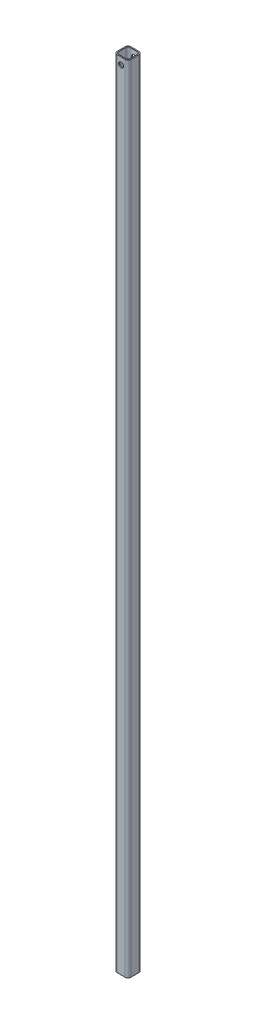
ISO-10303-21;
HEADER;
FILE_DESCRIPTION(('STEP AP214'),'2;1');
FILE_NAME('part.step','',(''),(''),'','','');
FILE_SCHEMA(('AUTOMOTIVE_DESIGN { 1 0 10303 214 1 1 1 1 }'));
ENDSEC;
DATA;
#1=APPLICATION_CONTEXT('core data for automotive mechanical design processes');
#2=APPLICATION_PROTOCOL_DEFINITION('international standard','automotive_design',2000,#1);
#3=PRODUCT_CONTEXT('',#1,'mechanical');
#4=PRODUCT('Part','Part','',(#3));
#5=PRODUCT_RELATED_PRODUCT_CATEGORY('part','',(#4));
#6=PRODUCT_DEFINITION_FORMATION('','',#4);
#7=PRODUCT_DEFINITION_CONTEXT('part definition',#1,'design');
#8=PRODUCT_DEFINITION('design','',#6,#7);
#9=PRODUCT_DEFINITION_SHAPE('','',#8);
#10=(LENGTH_UNIT() NAMED_UNIT(*) SI_UNIT(.MILLI.,.METRE.));
#11=(NAMED_UNIT(*) PLANE_ANGLE_UNIT() SI_UNIT($,.RADIAN.));
#12=(NAMED_UNIT(*) SI_UNIT($,.STERADIAN.) SOLID_ANGLE_UNIT());
#13=UNCERTAINTY_MEASURE_WITH_UNIT(LENGTH_MEASURE(1.E-05),#10,'distance_accuracy_value','');
#14=(GEOMETRIC_REPRESENTATION_CONTEXT(3) GLOBAL_UNCERTAINTY_ASSIGNED_CONTEXT((#13)) GLOBAL_UNIT_ASSIGNED_CONTEXT((#10,
#11,#12)) REPRESENTATION_CONTEXT('',''));
#15=CARTESIAN_POINT('',(0.,0.,0.));
#16=DIRECTION('',(0.,0.,1.));
#17=DIRECTION('',(1.,0.,0.));
#18=AXIS2_PLACEMENT_3D('',#15,#16,#17);
#19=CARTESIAN_POINT('',(9.525,914.4,-9.525));
#20=DIRECTION('',(0.,1.,0.));
#21=DIRECTION('',(0.,0.,1.));
#22=AXIS2_PLACEMENT_3D('',#19,#20,#21);
#23=PLANE('',#22);
#24=CARTESIAN_POINT('',(9.525,914.4,-9.525));
#25=DIRECTION('',(0.,1.,0.));
#26=DIRECTION('',(0.,0.,1.));
#27=AXIS2_PLACEMENT_3D('',#24,#25,#26);
#28=CIRCLE('',#27,6.35);
#29=CARTESIAN_POINT('',(15.875,914.4,-9.525));
#30=VERTEX_POINT('',#29);
#31=CARTESIAN_POINT('',(9.525,914.4,-15.875));
#32=VERTEX_POINT('',#31);
#33=EDGE_CURVE('E250',#30,#32,#28,.T.);
#34=ORIENTED_EDGE('',*,*,#33,.T.);
#35=DIRECTION('',(-1.,0.,0.));
#36=VECTOR('',#35,1.);
#37=CARTESIAN_POINT('',(9.525,914.4,-15.875));
#38=LINE('',#37,#36);
#39=CARTESIAN_POINT('',(-9.525,914.4,-15.875));
#40=VERTEX_POINT('',#39);
#41=EDGE_CURVE('E254',#32,#40,#38,.T.);
#42=ORIENTED_EDGE('',*,*,#41,.T.);
#43=CARTESIAN_POINT('',(-9.525,914.4,-9.525));
#44=DIRECTION('',(0.,1.,0.));
#45=DIRECTION('',(0.,0.,1.));
#46=AXIS2_PLACEMENT_3D('',#43,#44,#45);
#47=CIRCLE('',#46,6.35);
#48=CARTESIAN_POINT('',(-15.875,914.4,-9.525));
#49=VERTEX_POINT('',#48);
#50=EDGE_CURVE('E258',#40,#49,#47,.T.);
#51=ORIENTED_EDGE('',*,*,#50,.T.);
#52=DIRECTION('',(0.,0.,1.));
#53=VECTOR('',#52,1.);
#54=CARTESIAN_POINT('',(-15.875,914.4,9.525));
#55=LINE('',#54,#53);
#56=CARTESIAN_POINT('',(-15.875,914.4,9.525));
#57=VERTEX_POINT('',#56);
#58=EDGE_CURVE('E261',#49,#57,#55,.T.);
#59=ORIENTED_EDGE('',*,*,#58,.T.);
#60=CARTESIAN_POINT('',(-9.525,914.4,9.525));
#61=DIRECTION('',(0.,1.,0.));
#62=DIRECTION('',(0.,0.,1.));
#63=AXIS2_PLACEMENT_3D('',#60,#61,#62);
#64=CIRCLE('',#63,6.35);
#65=CARTESIAN_POINT('',(-9.525,914.4,15.875));
#66=VERTEX_POINT('',#65);
#67=EDGE_CURVE('E264',#57,#66,#64,.T.);
#68=ORIENTED_EDGE('',*,*,#67,.T.);
#69=DIRECTION('',(1.,0.,0.));
#70=VECTOR('',#69,1.);
#71=CARTESIAN_POINT('',(-9.525,914.4,15.875));
#72=LINE('',#71,#70);
#73=CARTESIAN_POINT('',(9.525,914.4,15.875));
#74=VERTEX_POINT('',#73);
#75=EDGE_CURVE('E267',#66,#74,#72,.T.);
#76=ORIENTED_EDGE('',*,*,#75,.T.);
#77=CARTESIAN_POINT('',(9.525,914.4,9.525));
#78=DIRECTION('',(0.,1.,0.));
#79=DIRECTION('',(0.,0.,1.));
#80=AXIS2_PLACEMENT_3D('',#77,#78,#79);
#81=CIRCLE('',#80,6.35);
#82=CARTESIAN_POINT('',(15.875,914.4,9.525));
#83=VERTEX_POINT('',#82);
#84=EDGE_CURVE('E270',#74,#83,#81,.T.);
#85=ORIENTED_EDGE('',*,*,#84,.T.);
#86=DIRECTION('',(0.,0.,-1.));
#87=VECTOR('',#86,1.);
#88=CARTESIAN_POINT('',(15.875,914.4,-9.525));
#89=LINE('',#88,#87);
#90=EDGE_CURVE('E273',#83,#30,#89,.T.);
#91=ORIENTED_EDGE('',*,*,#90,.T.);
#92=EDGE_LOOP('',(#34,#42,#51,#59,#68,#76,#85,#91));
#93=FACE_BOUND('',#92,.T.);
#94=DIRECTION('',(0.,0.,1.));
#95=VECTOR('',#94,1.);
#96=CARTESIAN_POINT('',(-13.462,914.4,8.6995));
#97=LINE('',#96,#95);
#98=CARTESIAN_POINT('',(-13.462,914.4,-8.6995));
#99=VERTEX_POINT('',#98);
#100=CARTESIAN_POINT('',(-13.462,914.4,8.6995));
#101=VERTEX_POINT('',#100);
#102=EDGE_CURVE('E176',#99,#101,#97,.T.);
#103=ORIENTED_EDGE('',*,*,#102,.F.);
#104=CARTESIAN_POINT('',(-8.6995,914.4,-8.6995));
#105=DIRECTION('',(0.,1.,0.));
#106=DIRECTION('',(0.,0.,1.));
#107=AXIS2_PLACEMENT_3D('',#104,#105,#106);
#108=CIRCLE('',#107,4.7625);
#109=CARTESIAN_POINT('',(-8.6995,914.4,-13.462));
#110=VERTEX_POINT('',#109);
#111=EDGE_CURVE('E167',#110,#99,#108,.T.);
#112=ORIENTED_EDGE('',*,*,#111,.F.);
#113=DIRECTION('',(-1.,0.,0.));
#114=VECTOR('',#113,1.);
#115=CARTESIAN_POINT('',(8.6995,914.4,-13.462));
#116=LINE('',#115,#114);
#117=CARTESIAN_POINT('',(8.6995,914.4,-13.462));
#118=VERTEX_POINT('',#117);
#119=EDGE_CURVE('E210',#118,#110,#116,.T.);
#120=ORIENTED_EDGE('',*,*,#119,.F.);
#121=CARTESIAN_POINT('',(8.6995,914.4,-8.69950000000001));
#122=DIRECTION('',(0.,1.,0.));
#123=DIRECTION('',(0.,0.,1.));
#124=AXIS2_PLACEMENT_3D('',#121,#122,#123);
#125=CIRCLE('',#124,4.7625);
#126=CARTESIAN_POINT('',(13.462,914.4,-8.69950000000001));
#127=VERTEX_POINT('',#126);
#128=EDGE_CURVE('E207',#127,#118,#125,.T.);
#129=ORIENTED_EDGE('',*,*,#128,.F.);
#130=DIRECTION('',(0.,0.,-1.));
#131=VECTOR('',#130,1.);
#132=CARTESIAN_POINT('',(13.462,914.4,-8.69950000000001));
#133=LINE('',#132,#131);
#134=CARTESIAN_POINT('',(13.462,914.4,8.69950000000001));
#135=VERTEX_POINT('',#134);
#136=EDGE_CURVE('E204',#135,#127,#133,.T.);
#137=ORIENTED_EDGE('',*,*,#136,.F.);
#138=CARTESIAN_POINT('',(8.6995,914.4,8.69950000000001));
#139=DIRECTION('',(0.,1.,0.));
#140=DIRECTION('',(0.,0.,1.));
#141=AXIS2_PLACEMENT_3D('',#138,#139,#140);
#142=CIRCLE('',#141,4.7625);
#143=CARTESIAN_POINT('',(8.6995,914.4,13.462));
#144=VERTEX_POINT('',#143);
#145=EDGE_CURVE('E201',#144,#135,#142,.T.);
#146=ORIENTED_EDGE('',*,*,#145,.F.);
#147=DIRECTION('',(1.,0.,0.));
#148=VECTOR('',#147,1.);
#149=CARTESIAN_POINT('',(-8.6995,914.4,13.462));
#150=LINE('',#149,#148);
#151=CARTESIAN_POINT('',(-8.6995,914.4,13.462));
#152=VERTEX_POINT('',#151);
#153=EDGE_CURVE('E195',#152,#144,#150,.T.);
#154=ORIENTED_EDGE('',*,*,#153,.F.);
#155=CARTESIAN_POINT('',(-8.6995,914.4,8.6995));
#156=DIRECTION('',(0.,1.,0.));
#157=DIRECTION('',(0.,0.,1.));
#158=AXIS2_PLACEMENT_3D('',#155,#156,#157);
#159=CIRCLE('',#158,4.7625);
#160=EDGE_CURVE('E190',#101,#152,#159,.T.);
#161=ORIENTED_EDGE('',*,*,#160,.F.);
#162=EDGE_LOOP('',(#103,#112,#120,#129,#137,#146,#154,#161));
#163=FACE_BOUND('',#162,.T.);
#164=ADVANCED_FACE('F36',(#93,#163),#23,.T.);
#165=CARTESIAN_POINT('',(9.525,-914.4,-9.525));
#166=DIRECTION('',(0.,1.,0.));
#167=DIRECTION('',(0.,0.,1.));
#168=AXIS2_PLACEMENT_3D('',#165,#166,#167);
#169=PLANE('',#168);
#170=CARTESIAN_POINT('',(9.525,-914.4,-9.525));
#171=DIRECTION('',(0.,1.,0.));
#172=DIRECTION('',(0.,0.,1.));
#173=AXIS2_PLACEMENT_3D('',#170,#171,#172);
#174=CIRCLE('',#173,6.35);
#175=CARTESIAN_POINT('',(15.875,-914.4,-9.525));
#176=VERTEX_POINT('',#175);
#177=CARTESIAN_POINT('',(9.525,-914.4,-15.875));
#178=VERTEX_POINT('',#177);
#179=EDGE_CURVE('E185',#176,#178,#174,.T.);
#180=ORIENTED_EDGE('',*,*,#179,.F.);
#181=DIRECTION('',(0.,0.,-1.));
#182=VECTOR('',#181,1.);
#183=CARTESIAN_POINT('',(15.875,-914.4,-9.525));
#184=LINE('',#183,#182);
#185=CARTESIAN_POINT('',(15.875,-914.4,9.525));
#186=VERTEX_POINT('',#185);
#187=EDGE_CURVE('E255',#186,#176,#184,.T.);
#188=ORIENTED_EDGE('',*,*,#187,.F.);
#189=CARTESIAN_POINT('',(9.525,-914.4,9.525));
#190=DIRECTION('',(0.,1.,0.));
#191=DIRECTION('',(0.,0.,1.));
#192=AXIS2_PLACEMENT_3D('',#189,#190,#191);
#193=CIRCLE('',#192,6.35);
#194=CARTESIAN_POINT('',(9.525,-914.4,15.875));
#195=VERTEX_POINT('',#194);
#196=EDGE_CURVE('E289',#195,#186,#193,.T.);
#197=ORIENTED_EDGE('',*,*,#196,.F.);
#198=DIRECTION('',(1.,0.,0.));
#199=VECTOR('',#198,1.);
#200=CARTESIAN_POINT('',(-9.525,-914.4,15.875));
#201=LINE('',#200,#199);
#202=CARTESIAN_POINT('',(-9.525,-914.4,15.875));
#203=VERTEX_POINT('',#202);
#204=EDGE_CURVE('E287',#203,#195,#201,.T.);
#205=ORIENTED_EDGE('',*,*,#204,.F.);
#206=CARTESIAN_POINT('',(-9.525,-914.4,9.525));
#207=DIRECTION('',(0.,1.,0.));
#208=DIRECTION('',(0.,0.,1.));
#209=AXIS2_PLACEMENT_3D('',#206,#207,#208);
#210=CIRCLE('',#209,6.35);
#211=CARTESIAN_POINT('',(-15.875,-914.4,9.525));
#212=VERTEX_POINT('',#211);
#213=EDGE_CURVE('E285',#212,#203,#210,.T.);
#214=ORIENTED_EDGE('',*,*,#213,.F.);
#215=DIRECTION('',(0.,0.,1.));
#216=VECTOR('',#215,1.);
#217=CARTESIAN_POINT('',(-15.875,-914.4,9.525));
#218=LINE('',#217,#216);
#219=CARTESIAN_POINT('',(-15.875,-914.4,-9.525));
#220=VERTEX_POINT('',#219);
#221=EDGE_CURVE('E283',#220,#212,#218,.T.);
#222=ORIENTED_EDGE('',*,*,#221,.F.);
#223=CARTESIAN_POINT('',(-9.525,-914.4,-9.525));
#224=DIRECTION('',(0.,1.,0.));
#225=DIRECTION('',(0.,0.,1.));
#226=AXIS2_PLACEMENT_3D('',#223,#224,#225);
#227=CIRCLE('',#226,6.35);
#228=CARTESIAN_POINT('',(-9.525,-914.4,-15.875));
#229=VERTEX_POINT('',#228);
#230=EDGE_CURVE('E281',#229,#220,#227,.T.);
#231=ORIENTED_EDGE('',*,*,#230,.F.);
#232=DIRECTION('',(-1.,0.,0.));
#233=VECTOR('',#232,1.);
#234=CARTESIAN_POINT('',(9.525,-914.4,-15.875));
#235=LINE('',#234,#233);
#236=EDGE_CURVE('E279',#178,#229,#235,.T.);
#237=ORIENTED_EDGE('',*,*,#236,.F.);
#238=EDGE_LOOP('',(#180,#188,#197,#205,#214,#222,#231,#237));
#239=FACE_BOUND('',#238,.T.);
#240=CARTESIAN_POINT('',(-8.6995,-914.4,-8.6995));
#241=DIRECTION('',(0.,1.,0.));
#242=DIRECTION('',(0.,0.,1.));
#243=AXIS2_PLACEMENT_3D('',#240,#241,#242);
#244=CIRCLE('',#243,4.7625);
#245=CARTESIAN_POINT('',(-8.6995,-914.4,-13.462));
#246=VERTEX_POINT('',#245);
#247=CARTESIAN_POINT('',(-13.462,-914.4,-8.6995));
#248=VERTEX_POINT('',#247);
#249=EDGE_CURVE('E64',#246,#248,#244,.T.);
#250=ORIENTED_EDGE('',*,*,#249,.T.);
#251=DIRECTION('',(0.,0.,1.));
#252=VECTOR('',#251,1.);
#253=CARTESIAN_POINT('',(-13.462,-914.4,8.6995));
#254=LINE('',#253,#252);
#255=CARTESIAN_POINT('',(-13.462,-914.4,8.6995));
#256=VERTEX_POINT('',#255);
#257=EDGE_CURVE('E183',#248,#256,#254,.T.);
#258=ORIENTED_EDGE('',*,*,#257,.T.);
#259=CARTESIAN_POINT('',(-8.6995,-914.4,8.6995));
#260=DIRECTION('',(0.,1.,0.));
#261=DIRECTION('',(0.,0.,1.));
#262=AXIS2_PLACEMENT_3D('',#259,#260,#261);
#263=CIRCLE('',#262,4.7625);
#264=CARTESIAN_POINT('',(-8.6995,-914.4,13.462));
#265=VERTEX_POINT('',#264);
#266=EDGE_CURVE('E216',#256,#265,#263,.T.);
#267=ORIENTED_EDGE('',*,*,#266,.T.);
#268=DIRECTION('',(1.,0.,0.));
#269=VECTOR('',#268,1.);
#270=CARTESIAN_POINT('',(-8.6995,-914.4,13.462));
#271=LINE('',#270,#269);
#272=CARTESIAN_POINT('',(8.6995,-914.4,13.462));
#273=VERTEX_POINT('',#272);
#274=EDGE_CURVE('E219',#265,#273,#271,.T.);
#275=ORIENTED_EDGE('',*,*,#274,.T.);
#276=CARTESIAN_POINT('',(8.6995,-914.4,8.69950000000001));
#277=DIRECTION('',(0.,1.,0.));
#278=DIRECTION('',(0.,0.,1.));
#279=AXIS2_PLACEMENT_3D('',#276,#277,#278);
#280=CIRCLE('',#279,4.7625);
#281=CARTESIAN_POINT('',(13.462,-914.4,8.69950000000001));
#282=VERTEX_POINT('',#281);
#283=EDGE_CURVE('E222',#273,#282,#280,.T.);
#284=ORIENTED_EDGE('',*,*,#283,.T.);
#285=DIRECTION('',(0.,0.,-1.));
#286=VECTOR('',#285,1.);
#287=CARTESIAN_POINT('',(13.462,-914.4,-8.69950000000001));
#288=LINE('',#287,#286);
#289=CARTESIAN_POINT('',(13.462,-914.4,-8.69950000000001));
#290=VERTEX_POINT('',#289);
#291=EDGE_CURVE('E225',#282,#290,#288,.T.);
#292=ORIENTED_EDGE('',*,*,#291,.T.);
#293=CARTESIAN_POINT('',(8.6995,-914.4,-8.69950000000001));
#294=DIRECTION('',(0.,1.,0.));
#295=DIRECTION('',(0.,0.,1.));
#296=AXIS2_PLACEMENT_3D('',#293,#294,#295);
#297=CIRCLE('',#296,4.7625);
#298=CARTESIAN_POINT('',(8.6995,-914.4,-13.462));
#299=VERTEX_POINT('',#298);
#300=EDGE_CURVE('E228',#290,#299,#297,.T.);
#301=ORIENTED_EDGE('',*,*,#300,.T.);
#302=DIRECTION('',(-1.,0.,0.));
#303=VECTOR('',#302,1.);
#304=CARTESIAN_POINT('',(8.6995,-914.4,-13.462));
#305=LINE('',#304,#303);
#306=EDGE_CURVE('E177',#299,#246,#305,.T.);
#307=ORIENTED_EDGE('',*,*,#306,.T.);
#308=EDGE_LOOP('',(#250,#258,#267,#275,#284,#292,#301,#307));
#309=FACE_BOUND('',#308,.T.);
#310=ADVANCED_FACE('F328',(#239,#309),#169,.F.);
#311=CARTESIAN_POINT('',(9.525,914.4,-9.525));
#312=DIRECTION('',(0.,-1.,0.));
#313=DIRECTION('',(0.,0.,-1.));
#314=AXIS2_PLACEMENT_3D('',#311,#312,#313);
#315=CYLINDRICAL_SURFACE('',#314,6.35);
#316=ORIENTED_EDGE('',*,*,#179,.T.);
#317=DIRECTION('',(0.,-1.,0.));
#318=VECTOR('',#317,1.);
#319=CARTESIAN_POINT('',(9.525,914.4,-15.875));
#320=LINE('',#319,#318);
#321=EDGE_CURVE('E11',#32,#178,#320,.T.);
#322=ORIENTED_EDGE('',*,*,#321,.F.);
#323=ORIENTED_EDGE('',*,*,#33,.F.);
#324=DIRECTION('',(0.,-1.,0.));
#325=VECTOR('',#324,1.);
#326=CARTESIAN_POINT('',(15.875,914.4,-9.525));
#327=LINE('',#326,#325);
#328=EDGE_CURVE('E276',#30,#176,#327,.T.);
#329=ORIENTED_EDGE('',*,*,#328,.T.);
#330=EDGE_LOOP('',(#316,#322,#323,#329));
#331=FACE_BOUND('',#330,.T.);
#332=ADVANCED_FACE('F38',(#331),#315,.T.);
#333=CARTESIAN_POINT('',(9.525,914.4,-15.875));
#334=DIRECTION('',(0.,0.,1.));
#335=DIRECTION('',(1.,0.,0.));
#336=AXIS2_PLACEMENT_3D('',#333,#334,#335);
#337=PLANE('',#336);
#338=CARTESIAN_POINT('',(0.,898.525,-15.875));
#339=DIRECTION('',(0.,0.,1.));
#340=DIRECTION('',(1.,0.,0.));
#341=AXIS2_PLACEMENT_3D('',#338,#339,#340);
#342=CIRCLE('',#341,5.71499999999998);
#343=CARTESIAN_POINT('',(5.71499999999998,898.525,-15.875));
#344=VERTEX_POINT('',#343);
#345=EDGE_CURVE('E425',#344,#344,#342,.T.);
#346=ORIENTED_EDGE('',*,*,#345,.T.);
#347=EDGE_LOOP('',(#346));
#348=FACE_BOUND('',#347,.T.);
#349=ORIENTED_EDGE('',*,*,#236,.T.);
#350=DIRECTION('',(0.,-1.,0.));
#351=VECTOR('',#350,1.);
#352=CARTESIAN_POINT('',(-9.525,914.4,-15.875));
#353=LINE('',#352,#351);
#354=EDGE_CURVE('E46',#40,#229,#353,.T.);
#355=ORIENTED_EDGE('',*,*,#354,.F.);
#356=ORIENTED_EDGE('',*,*,#41,.F.);
#357=ORIENTED_EDGE('',*,*,#321,.T.);
#358=EDGE_LOOP('',(#349,#355,#356,#357));
#359=FACE_BOUND('',#358,.T.);
#360=ADVANCED_FACE('F345',(#348,#359),#337,.F.);
#361=CARTESIAN_POINT('',(-9.525,914.4,-9.525));
#362=DIRECTION('',(0.,-1.,0.));
#363=DIRECTION('',(0.,0.,-1.));
#364=AXIS2_PLACEMENT_3D('',#361,#362,#363);
#365=CYLINDRICAL_SURFACE('',#364,6.35);
#366=ORIENTED_EDGE('',*,*,#230,.T.);
#367=DIRECTION('',(0.,-1.,0.));
#368=VECTOR('',#367,1.);
#369=CARTESIAN_POINT('',(-15.875,914.4,-9.525));
#370=LINE('',#369,#368);
#371=EDGE_CURVE('E311',#49,#220,#370,.T.);
#372=ORIENTED_EDGE('',*,*,#371,.F.);
#373=ORIENTED_EDGE('',*,*,#50,.F.);
#374=ORIENTED_EDGE('',*,*,#354,.T.);
#375=EDGE_LOOP('',(#366,#372,#373,#374));
#376=FACE_BOUND('',#375,.T.);
#377=ADVANCED_FACE('F322',(#376),#365,.T.);
#378=CARTESIAN_POINT('',(-15.875,914.4,9.525));
#379=DIRECTION('',(1.,0.,0.));
#380=DIRECTION('',(0.,0.,-1.));
#381=AXIS2_PLACEMENT_3D('',#378,#379,#380);
#382=PLANE('',#381);
#383=ORIENTED_EDGE('',*,*,#221,.T.);
#384=DIRECTION('',(0.,-1.,0.));
#385=VECTOR('',#384,1.);
#386=CARTESIAN_POINT('',(-15.875,914.4,9.525));
#387=LINE('',#386,#385);
#388=EDGE_CURVE('E307',#57,#212,#387,.T.);
#389=ORIENTED_EDGE('',*,*,#388,.F.);
#390=ORIENTED_EDGE('',*,*,#58,.F.);
#391=ORIENTED_EDGE('',*,*,#371,.T.);
#392=EDGE_LOOP('',(#383,#389,#390,#391));
#393=FACE_BOUND('',#392,.T.);
#394=ADVANCED_FACE('F334',(#393),#382,.F.);
#395=CARTESIAN_POINT('',(-9.525,914.4,9.525));
#396=DIRECTION('',(0.,-1.,0.));
#397=DIRECTION('',(0.,0.,-1.));
#398=AXIS2_PLACEMENT_3D('',#395,#396,#397);
#399=CYLINDRICAL_SURFACE('',#398,6.35);
#400=ORIENTED_EDGE('',*,*,#213,.T.);
#401=DIRECTION('',(0.,-1.,0.));
#402=VECTOR('',#401,1.);
#403=CARTESIAN_POINT('',(-9.525,914.4,15.875));
#404=LINE('',#403,#402);
#405=EDGE_CURVE('E303',#66,#203,#404,.T.);
#406=ORIENTED_EDGE('',*,*,#405,.F.);
#407=ORIENTED_EDGE('',*,*,#67,.F.);
#408=ORIENTED_EDGE('',*,*,#388,.T.);
#409=EDGE_LOOP('',(#400,#406,#407,#408));
#410=FACE_BOUND('',#409,.T.);
#411=ADVANCED_FACE('F338',(#410),#399,.T.);
#412=CARTESIAN_POINT('',(-9.525,914.4,15.875));
#413=DIRECTION('',(0.,0.,-1.));
#414=DIRECTION('',(-1.,0.,0.));
#415=AXIS2_PLACEMENT_3D('',#412,#413,#414);
#416=PLANE('',#415);
#417=CARTESIAN_POINT('',(0.,898.525,15.875));
#418=DIRECTION('',(0.,0.,1.));
#419=DIRECTION('',(1.,0.,0.));
#420=AXIS2_PLACEMENT_3D('',#417,#418,#419);
#421=CIRCLE('',#420,5.71499999999998);
#422=CARTESIAN_POINT('',(5.71499999999998,898.525,15.875));
#423=VERTEX_POINT('',#422);
#424=EDGE_CURVE('E428',#423,#423,#421,.T.);
#425=ORIENTED_EDGE('',*,*,#424,.F.);
#426=EDGE_LOOP('',(#425));
#427=FACE_BOUND('',#426,.T.);
#428=ORIENTED_EDGE('',*,*,#204,.T.);
#429=DIRECTION('',(0.,-1.,0.));
#430=VECTOR('',#429,1.);
#431=CARTESIAN_POINT('',(9.525,914.4,15.875));
#432=LINE('',#431,#430);
#433=EDGE_CURVE('E299',#74,#195,#432,.T.);
#434=ORIENTED_EDGE('',*,*,#433,.F.);
#435=ORIENTED_EDGE('',*,*,#75,.F.);
#436=ORIENTED_EDGE('',*,*,#405,.T.);
#437=EDGE_LOOP('',(#428,#434,#435,#436));
#438=FACE_BOUND('',#437,.T.);
#439=ADVANCED_FACE('F358',(#427,#438),#416,.F.);
#440=CARTESIAN_POINT('',(9.525,914.4,9.525));
#441=DIRECTION('',(0.,-1.,0.));
#442=DIRECTION('',(0.,0.,-1.));
#443=AXIS2_PLACEMENT_3D('',#440,#441,#442);
#444=CYLINDRICAL_SURFACE('',#443,6.35);
#445=ORIENTED_EDGE('',*,*,#196,.T.);
#446=DIRECTION('',(0.,-1.,0.));
#447=VECTOR('',#446,1.);
#448=CARTESIAN_POINT('',(15.875,914.4,9.525));
#449=LINE('',#448,#447);
#450=EDGE_CURVE('E295',#83,#186,#449,.T.);
#451=ORIENTED_EDGE('',*,*,#450,.F.);
#452=ORIENTED_EDGE('',*,*,#84,.F.);
#453=ORIENTED_EDGE('',*,*,#433,.T.);
#454=EDGE_LOOP('',(#445,#451,#452,#453));
#455=FACE_BOUND('',#454,.T.);
#456=ADVANCED_FACE('F356',(#455),#444,.T.);
#457=CARTESIAN_POINT('',(15.875,914.4,-9.525));
#458=DIRECTION('',(-1.,0.,0.));
#459=DIRECTION('',(0.,0.,1.));
#460=AXIS2_PLACEMENT_3D('',#457,#458,#459);
#461=PLANE('',#460);
#462=ORIENTED_EDGE('',*,*,#187,.T.);
#463=ORIENTED_EDGE('',*,*,#328,.F.);
#464=ORIENTED_EDGE('',*,*,#90,.F.);
#465=ORIENTED_EDGE('',*,*,#450,.T.);
#466=EDGE_LOOP('',(#462,#463,#464,#465));
#467=FACE_BOUND('',#466,.T.);
#468=ADVANCED_FACE('F351',(#467),#461,.F.);
#469=CARTESIAN_POINT('',(-8.6995,914.4,-8.6995));
#470=DIRECTION('',(0.,-1.,0.));
#471=DIRECTION('',(0.,0.,-1.));
#472=AXIS2_PLACEMENT_3D('',#469,#470,#471);
#473=CYLINDRICAL_SURFACE('',#472,4.7625);
#474=ORIENTED_EDGE('',*,*,#249,.F.);
#475=DIRECTION('',(0.,-1.,0.));
#476=VECTOR('',#475,1.);
#477=CARTESIAN_POINT('',(-8.6995,914.4,-13.462));
#478=LINE('',#477,#476);
#479=EDGE_CURVE('E171',#110,#246,#478,.T.);
#480=ORIENTED_EDGE('',*,*,#479,.F.);
#481=ORIENTED_EDGE('',*,*,#111,.T.);
#482=DIRECTION('',(0.,-1.,0.));
#483=VECTOR('',#482,1.);
#484=CARTESIAN_POINT('',(-13.462,914.4,-8.6995));
#485=LINE('',#484,#483);
#486=EDGE_CURVE('E170',#99,#248,#485,.T.);
#487=ORIENTED_EDGE('',*,*,#486,.T.);
#488=EDGE_LOOP('',(#474,#480,#481,#487));
#489=FACE_BOUND('',#488,.T.);
#490=ADVANCED_FACE('F169',(#489),#473,.F.);
#491=CARTESIAN_POINT('',(-13.462,914.4,8.6995));
#492=DIRECTION('',(1.,0.,0.));
#493=DIRECTION('',(0.,0.,-1.));
#494=AXIS2_PLACEMENT_3D('',#491,#492,#493);
#495=PLANE('',#494);
#496=ORIENTED_EDGE('',*,*,#257,.F.);
#497=ORIENTED_EDGE('',*,*,#486,.F.);
#498=ORIENTED_EDGE('',*,*,#102,.T.);
#499=DIRECTION('',(0.,-1.,0.));
#500=VECTOR('',#499,1.);
#501=CARTESIAN_POINT('',(-13.462,914.4,8.6995));
#502=LINE('',#501,#500);
#503=EDGE_CURVE('E186',#101,#256,#502,.T.);
#504=ORIENTED_EDGE('',*,*,#503,.T.);
#505=EDGE_LOOP('',(#496,#497,#498,#504));
#506=FACE_BOUND('',#505,.T.);
#507=ADVANCED_FACE('F180',(#506),#495,.T.);
#508=CARTESIAN_POINT('',(-8.6995,914.4,8.6995));
#509=DIRECTION('',(0.,-1.,0.));
#510=DIRECTION('',(0.,0.,-1.));
#511=AXIS2_PLACEMENT_3D('',#508,#509,#510);
#512=CYLINDRICAL_SURFACE('',#511,4.7625);
#513=ORIENTED_EDGE('',*,*,#266,.F.);
#514=ORIENTED_EDGE('',*,*,#503,.F.);
#515=ORIENTED_EDGE('',*,*,#160,.T.);
#516=DIRECTION('',(0.,-1.,0.));
#517=VECTOR('',#516,1.);
#518=CARTESIAN_POINT('',(-8.6995,914.4,13.462));
#519=LINE('',#518,#517);
#520=EDGE_CURVE('E245',#152,#265,#519,.T.);
#521=ORIENTED_EDGE('',*,*,#520,.T.);
#522=EDGE_LOOP('',(#513,#514,#515,#521));
#523=FACE_BOUND('',#522,.T.);
#524=ADVANCED_FACE('F385',(#523),#512,.F.);
#525=CARTESIAN_POINT('',(-8.6995,914.4,13.462));
#526=DIRECTION('',(0.,0.,-1.));
#527=DIRECTION('',(-1.,0.,0.));
#528=AXIS2_PLACEMENT_3D('',#525,#526,#527);
#529=PLANE('',#528);
#530=CARTESIAN_POINT('',(0.,898.525,13.462));
#531=DIRECTION('',(0.,0.,-1.));
#532=DIRECTION('',(-1.,0.,0.));
#533=AXIS2_PLACEMENT_3D('',#530,#531,#532);
#534=CIRCLE('',#533,5.71499999999998);
#535=CARTESIAN_POINT('',(-5.71499999999999,898.525,13.462));
#536=VERTEX_POINT('',#535);
#537=EDGE_CURVE('E214',#536,#536,#534,.T.);
#538=ORIENTED_EDGE('',*,*,#537,.F.);
#539=EDGE_LOOP('',(#538));
#540=FACE_BOUND('',#539,.T.);
#541=ORIENTED_EDGE('',*,*,#274,.F.);
#542=ORIENTED_EDGE('',*,*,#520,.F.);
#543=ORIENTED_EDGE('',*,*,#153,.T.);
#544=DIRECTION('',(0.,-1.,0.));
#545=VECTOR('',#544,1.);
#546=CARTESIAN_POINT('',(8.6995,914.4,13.462));
#547=LINE('',#546,#545);
#548=EDGE_CURVE('E242',#144,#273,#547,.T.);
#549=ORIENTED_EDGE('',*,*,#548,.T.);
#550=EDGE_LOOP('',(#541,#542,#543,#549));
#551=FACE_BOUND('',#550,.T.);
#552=ADVANCED_FACE('F389',(#540,#551),#529,.T.);
#553=CARTESIAN_POINT('',(8.6995,914.4,8.69950000000001));
#554=DIRECTION('',(0.,-1.,0.));
#555=DIRECTION('',(0.,0.,-1.));
#556=AXIS2_PLACEMENT_3D('',#553,#554,#555);
#557=CYLINDRICAL_SURFACE('',#556,4.7625);
#558=ORIENTED_EDGE('',*,*,#283,.F.);
#559=ORIENTED_EDGE('',*,*,#548,.F.);
#560=ORIENTED_EDGE('',*,*,#145,.T.);
#561=DIRECTION('',(0.,-1.,0.));
#562=VECTOR('',#561,1.);
#563=CARTESIAN_POINT('',(13.462,914.4,8.69950000000001));
#564=LINE('',#563,#562);
#565=EDGE_CURVE('E239',#135,#282,#564,.T.);
#566=ORIENTED_EDGE('',*,*,#565,.T.);
#567=EDGE_LOOP('',(#558,#559,#560,#566));
#568=FACE_BOUND('',#567,.T.);
#569=ADVANCED_FACE('F395',(#568),#557,.F.);
#570=CARTESIAN_POINT('',(13.462,914.4,-8.69950000000001));
#571=DIRECTION('',(-1.,0.,0.));
#572=DIRECTION('',(0.,0.,1.));
#573=AXIS2_PLACEMENT_3D('',#570,#571,#572);
#574=PLANE('',#573);
#575=ORIENTED_EDGE('',*,*,#291,.F.);
#576=ORIENTED_EDGE('',*,*,#565,.F.);
#577=ORIENTED_EDGE('',*,*,#136,.T.);
#578=DIRECTION('',(0.,-1.,0.));
#579=VECTOR('',#578,1.);
#580=CARTESIAN_POINT('',(13.462,914.4,-8.69950000000001));
#581=LINE('',#580,#579);
#582=EDGE_CURVE('E236',#127,#290,#581,.T.);
#583=ORIENTED_EDGE('',*,*,#582,.T.);
#584=EDGE_LOOP('',(#575,#576,#577,#583));
#585=FACE_BOUND('',#584,.T.);
#586=ADVANCED_FACE('F399',(#585),#574,.T.);
#587=CARTESIAN_POINT('',(8.6995,914.4,-8.69950000000001));
#588=DIRECTION('',(0.,-1.,0.));
#589=DIRECTION('',(0.,0.,-1.));
#590=AXIS2_PLACEMENT_3D('',#587,#588,#589);
#591=CYLINDRICAL_SURFACE('',#590,4.7625);
#592=ORIENTED_EDGE('',*,*,#300,.F.);
#593=ORIENTED_EDGE('',*,*,#582,.F.);
#594=ORIENTED_EDGE('',*,*,#128,.T.);
#595=DIRECTION('',(0.,-1.,0.));
#596=VECTOR('',#595,1.);
#597=CARTESIAN_POINT('',(8.6995,914.4,-13.462));
#598=LINE('',#597,#596);
#599=EDGE_CURVE('E56',#118,#299,#598,.T.);
#600=ORIENTED_EDGE('',*,*,#599,.T.);
#601=EDGE_LOOP('',(#592,#593,#594,#600));
#602=FACE_BOUND('',#601,.T.);
#603=ADVANCED_FACE('F403',(#602),#591,.F.);
#604=CARTESIAN_POINT('',(8.6995,914.4,-13.462));
#605=DIRECTION('',(0.,0.,1.));
#606=DIRECTION('',(1.,0.,0.));
#607=AXIS2_PLACEMENT_3D('',#604,#605,#606);
#608=PLANE('',#607);
#609=CARTESIAN_POINT('',(0.,898.525,-13.462));
#610=DIRECTION('',(0.,0.,1.));
#611=DIRECTION('',(1.,0.,0.));
#612=AXIS2_PLACEMENT_3D('',#609,#610,#611);
#613=CIRCLE('',#612,5.71499999999998);
#614=CARTESIAN_POINT('',(5.71499999999998,898.525,-13.462));
#615=VERTEX_POINT('',#614);
#616=EDGE_CURVE('E40',#615,#615,#613,.T.);
#617=ORIENTED_EDGE('',*,*,#616,.F.);
#618=EDGE_LOOP('',(#617));
#619=FACE_BOUND('',#618,.T.);
#620=ORIENTED_EDGE('',*,*,#306,.F.);
#621=ORIENTED_EDGE('',*,*,#599,.F.);
#622=ORIENTED_EDGE('',*,*,#119,.T.);
#623=ORIENTED_EDGE('',*,*,#479,.T.);
#624=EDGE_LOOP('',(#620,#621,#622,#623));
#625=FACE_BOUND('',#624,.T.);
#626=ADVANCED_FACE('F407',(#619,#625),#608,.T.);
#627=CARTESIAN_POINT('',(0.,898.525,-15.875));
#628=DIRECTION('',(0.,0.,1.));
#629=DIRECTION('',(1.,0.,0.));
#630=AXIS2_PLACEMENT_3D('',#627,#628,#629);
#631=CYLINDRICAL_SURFACE('',#630,5.71499999999998);
#632=ORIENTED_EDGE('',*,*,#616,.T.);
#633=EDGE_LOOP('',(#632));
#634=FACE_BOUND('',#633,.T.);
#635=ORIENTED_EDGE('',*,*,#345,.F.);
#636=EDGE_LOOP('',(#635));
#637=FACE_BOUND('',#636,.T.);
#638=ADVANCED_FACE('F411',(#634,#637),#631,.F.);
#639=ORIENTED_EDGE('',*,*,#537,.T.);
#640=EDGE_LOOP('',(#639));
#641=FACE_BOUND('',#640,.T.);
#642=ORIENTED_EDGE('',*,*,#424,.T.);
#643=EDGE_LOOP('',(#642));
#644=FACE_BOUND('',#643,.T.);
#645=ADVANCED_FACE('F414',(#641,#644),#631,.F.);
#646=CLOSED_SHELL('',(#164,#310,#332,#360,#377,#394,#411,#439,#456,#468,#490,#507,#524,#552,
#569,#586,#603,#626,#638,#645));
#647=MANIFOLD_SOLID_BREP('B2',#646);
#648=ADVANCED_BREP_SHAPE_REPRESENTATION('',(#18,#647),#14);
#649=SHAPE_DEFINITION_REPRESENTATION(#9,#648);
ENDSEC;
END-ISO-10303-21;
